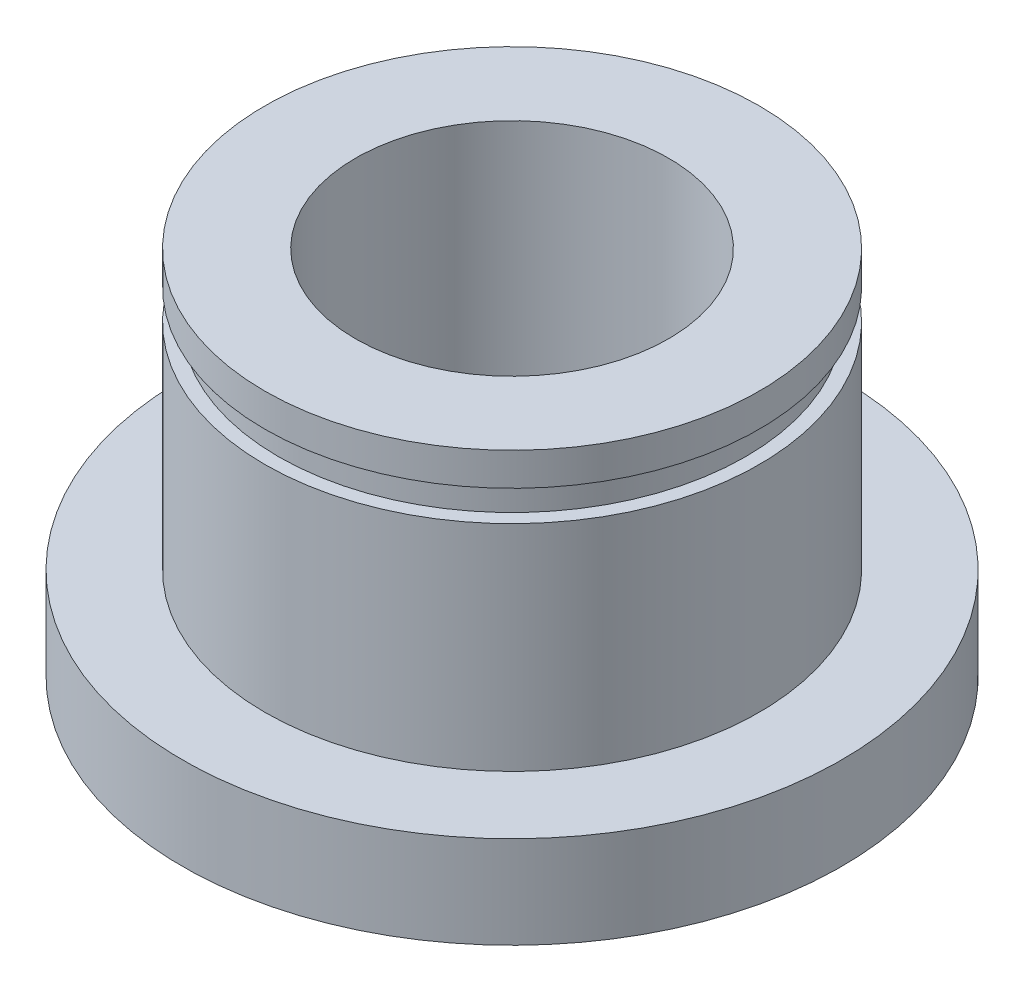
ISO-10303-21;
HEADER;
FILE_DESCRIPTION(('STEP AP214'),'2;1');
FILE_NAME('part.step','',(''),(''),'','','');
FILE_SCHEMA(('AUTOMOTIVE_DESIGN { 1 0 10303 214 1 1 1 1 }'));
ENDSEC;
DATA;
#1=APPLICATION_CONTEXT('core data for automotive mechanical design processes');
#2=APPLICATION_PROTOCOL_DEFINITION('international standard','automotive_design',2000,#1);
#3=PRODUCT_CONTEXT('',#1,'mechanical');
#4=PRODUCT('Part','Part','',(#3));
#5=PRODUCT_RELATED_PRODUCT_CATEGORY('part','',(#4));
#6=PRODUCT_DEFINITION_FORMATION('','',#4);
#7=PRODUCT_DEFINITION_CONTEXT('part definition',#1,'design');
#8=PRODUCT_DEFINITION('design','',#6,#7);
#9=PRODUCT_DEFINITION_SHAPE('','',#8);
#10=(LENGTH_UNIT() NAMED_UNIT(*) SI_UNIT(.MILLI.,.METRE.));
#11=(NAMED_UNIT(*) PLANE_ANGLE_UNIT() SI_UNIT($,.RADIAN.));
#12=(NAMED_UNIT(*) SI_UNIT($,.STERADIAN.) SOLID_ANGLE_UNIT());
#13=UNCERTAINTY_MEASURE_WITH_UNIT(LENGTH_MEASURE(1.E-05),#10,'distance_accuracy_value','');
#14=(GEOMETRIC_REPRESENTATION_CONTEXT(3) GLOBAL_UNCERTAINTY_ASSIGNED_CONTEXT((#13)) GLOBAL_UNIT_ASSIGNED_CONTEXT((#10,
#11,#12)) REPRESENTATION_CONTEXT('',''));
#15=CARTESIAN_POINT('',(0.,0.,0.));
#16=DIRECTION('',(0.,0.,1.));
#17=DIRECTION('',(1.,0.,0.));
#18=AXIS2_PLACEMENT_3D('',#15,#16,#17);
#19=CARTESIAN_POINT('',(0.,-4.460875,0.));
#20=DIRECTION('',(0.,1.,0.));
#21=DIRECTION('',(0.,0.,1.));
#22=AXIS2_PLACEMENT_3D('',#19,#20,#21);
#23=PLANE('',#22);
#24=CARTESIAN_POINT('',(0.,-4.460875,0.));
#25=DIRECTION('',(0.,1.,0.));
#26=DIRECTION('',(0.,0.,1.));
#27=AXIS2_PLACEMENT_3D('',#24,#25,#26);
#28=CIRCLE('',#27,4.564126);
#29=CARTESIAN_POINT('',(0.,-4.460875,4.564126));
#30=VERTEX_POINT('',#29);
#31=EDGE_CURVE('E39',#30,#30,#28,.T.);
#32=ORIENTED_EDGE('',*,*,#31,.T.);
#33=EDGE_LOOP('',(#32));
#34=FACE_BOUND('',#33,.T.);
#35=CARTESIAN_POINT('',(0.,-4.460875,0.));
#36=DIRECTION('',(0.,-1.,0.));
#37=DIRECTION('',(0.,0.,-1.));
#38=AXIS2_PLACEMENT_3D('',#35,#36,#37);
#39=CIRCLE('',#38,7.9375);
#40=CARTESIAN_POINT('',(0.,-4.460875,-7.9375));
#41=VERTEX_POINT('',#40);
#42=EDGE_CURVE('E43',#41,#41,#39,.T.);
#43=ORIENTED_EDGE('',*,*,#42,.T.);
#44=EDGE_LOOP('',(#43));
#45=FACE_BOUND('',#44,.T.);
#46=ADVANCED_FACE('F32',(#34,#45),#23,.F.);
#47=CARTESIAN_POINT('',(0.,0.,0.));
#48=DIRECTION('',(0.,-1.,0.));
#49=DIRECTION('',(0.,0.,-1.));
#50=AXIS2_PLACEMENT_3D('',#47,#48,#49);
#51=CYLINDRICAL_SURFACE('',#50,7.9375);
#52=ORIENTED_EDGE('',*,*,#42,.F.);
#53=EDGE_LOOP('',(#52));
#54=FACE_BOUND('',#53,.T.);
#55=CARTESIAN_POINT('',(0.,-2.238375,0.));
#56=DIRECTION('',(0.,-1.,0.));
#57=DIRECTION('',(0.,0.,-1.));
#58=AXIS2_PLACEMENT_3D('',#55,#56,#57);
#59=CIRCLE('',#58,7.9375);
#60=CARTESIAN_POINT('',(0.,-2.238375,-7.9375));
#61=VERTEX_POINT('',#60);
#62=EDGE_CURVE('E47',#61,#61,#59,.T.);
#63=ORIENTED_EDGE('',*,*,#62,.T.);
#64=EDGE_LOOP('',(#63));
#65=FACE_BOUND('',#64,.T.);
#66=ADVANCED_FACE('F95',(#54,#65),#51,.T.);
#67=CARTESIAN_POINT('',(0.,-2.238375,7.9375));
#68=DIRECTION('',(0.,-1.,0.));
#69=DIRECTION('',(0.,0.,-1.));
#70=AXIS2_PLACEMENT_3D('',#67,#68,#69);
#71=PLANE('',#70);
#72=ORIENTED_EDGE('',*,*,#62,.F.);
#73=EDGE_LOOP('',(#72));
#74=FACE_BOUND('',#73,.T.);
#75=CARTESIAN_POINT('',(0.,-2.238375,0.));
#76=DIRECTION('',(0.,-1.,0.));
#77=DIRECTION('',(0.,0.,-1.));
#78=AXIS2_PLACEMENT_3D('',#75,#76,#77);
#79=CIRCLE('',#78,5.953125);
#80=CARTESIAN_POINT('',(0.,-2.238375,-5.953125));
#81=VERTEX_POINT('',#80);
#82=EDGE_CURVE('E52',#81,#81,#79,.T.);
#83=ORIENTED_EDGE('',*,*,#82,.T.);
#84=EDGE_LOOP('',(#83));
#85=FACE_BOUND('',#84,.T.);
#86=ADVANCED_FACE('F99',(#74,#85),#71,.F.);
#87=CARTESIAN_POINT('',(0.,0.,0.));
#88=DIRECTION('',(0.,-1.,0.));
#89=DIRECTION('',(0.,0.,-1.));
#90=AXIS2_PLACEMENT_3D('',#87,#88,#89);
#91=CYLINDRICAL_SURFACE('',#90,5.953125);
#92=ORIENTED_EDGE('',*,*,#82,.F.);
#93=EDGE_LOOP('',(#92));
#94=FACE_BOUND('',#93,.T.);
#95=CARTESIAN_POINT('',(0.,2.930525,0.));
#96=DIRECTION('',(0.,-1.,0.));
#97=DIRECTION('',(0.,0.,-1.));
#98=AXIS2_PLACEMENT_3D('',#95,#96,#97);
#99=CIRCLE('',#98,5.953125);
#100=CARTESIAN_POINT('',(0.,2.930525,-5.953125));
#101=VERTEX_POINT('',#100);
#102=EDGE_CURVE('E55',#101,#101,#99,.T.);
#103=ORIENTED_EDGE('',*,*,#102,.T.);
#104=EDGE_LOOP('',(#103));
#105=FACE_BOUND('',#104,.T.);
#106=ADVANCED_FACE('F106',(#94,#105),#91,.T.);
#107=CARTESIAN_POINT('',(0.,2.930525,5.953125));
#108=DIRECTION('',(0.,-1.,0.));
#109=DIRECTION('',(0.,0.,-1.));
#110=AXIS2_PLACEMENT_3D('',#107,#108,#109);
#111=PLANE('',#110);
#112=ORIENTED_EDGE('',*,*,#102,.F.);
#113=EDGE_LOOP('',(#112));
#114=FACE_BOUND('',#113,.T.);
#115=CARTESIAN_POINT('',(0.,2.930525,0.));
#116=DIRECTION('',(0.,-1.,0.));
#117=DIRECTION('',(0.,0.,-1.));
#118=AXIS2_PLACEMENT_3D('',#115,#116,#117);
#119=CIRCLE('',#118,5.6261);
#120=CARTESIAN_POINT('',(0.,2.930525,-5.6261));
#121=VERTEX_POINT('',#120);
#122=EDGE_CURVE('E58',#121,#121,#119,.T.);
#123=ORIENTED_EDGE('',*,*,#122,.T.);
#124=EDGE_LOOP('',(#123));
#125=FACE_BOUND('',#124,.T.);
#126=ADVANCED_FACE('F110',(#114,#125),#111,.F.);
#127=CARTESIAN_POINT('',(0.,0.,0.));
#128=DIRECTION('',(0.,-1.,0.));
#129=DIRECTION('',(0.,0.,-1.));
#130=AXIS2_PLACEMENT_3D('',#127,#128,#129);
#131=CYLINDRICAL_SURFACE('',#130,5.6261);
#132=ORIENTED_EDGE('',*,*,#122,.F.);
#133=EDGE_LOOP('',(#132));
#134=FACE_BOUND('',#133,.T.);
#135=CARTESIAN_POINT('',(0.,3.667125,0.));
#136=DIRECTION('',(0.,-1.,0.));
#137=DIRECTION('',(0.,0.,-1.));
#138=AXIS2_PLACEMENT_3D('',#135,#136,#137);
#139=CIRCLE('',#138,5.6261);
#140=CARTESIAN_POINT('',(0.,3.667125,-5.6261));
#141=VERTEX_POINT('',#140);
#142=EDGE_CURVE('E61',#141,#141,#139,.T.);
#143=ORIENTED_EDGE('',*,*,#142,.T.);
#144=EDGE_LOOP('',(#143));
#145=FACE_BOUND('',#144,.T.);
#146=ADVANCED_FACE('F90',(#134,#145),#131,.T.);
#147=CARTESIAN_POINT('',(0.,3.667125,5.6261));
#148=DIRECTION('',(0.,1.,0.));
#149=DIRECTION('',(0.,0.,1.));
#150=AXIS2_PLACEMENT_3D('',#147,#148,#149);
#151=PLANE('',#150);
#152=ORIENTED_EDGE('',*,*,#142,.F.);
#153=EDGE_LOOP('',(#152));
#154=FACE_BOUND('',#153,.T.);
#155=CARTESIAN_POINT('',(0.,3.667125,0.));
#156=DIRECTION('',(0.,-1.,0.));
#157=DIRECTION('',(0.,0.,-1.));
#158=AXIS2_PLACEMENT_3D('',#155,#156,#157);
#159=CIRCLE('',#158,5.953125);
#160=CARTESIAN_POINT('',(0.,3.667125,-5.953125));
#161=VERTEX_POINT('',#160);
#162=EDGE_CURVE('E64',#161,#161,#159,.T.);
#163=ORIENTED_EDGE('',*,*,#162,.T.);
#164=EDGE_LOOP('',(#163));
#165=FACE_BOUND('',#164,.T.);
#166=ADVANCED_FACE('F84',(#154,#165),#151,.F.);
#167=CARTESIAN_POINT('',(0.,0.,0.));
#168=DIRECTION('',(0.,-1.,0.));
#169=DIRECTION('',(0.,0.,-1.));
#170=AXIS2_PLACEMENT_3D('',#167,#168,#169);
#171=CYLINDRICAL_SURFACE('',#170,5.953125);
#172=ORIENTED_EDGE('',*,*,#162,.F.);
#173=EDGE_LOOP('',(#172));
#174=FACE_BOUND('',#173,.T.);
#175=CARTESIAN_POINT('',(0.,4.460875,0.));
#176=DIRECTION('',(0.,-1.,0.));
#177=DIRECTION('',(0.,0.,-1.));
#178=AXIS2_PLACEMENT_3D('',#175,#176,#177);
#179=CIRCLE('',#178,5.953125);
#180=CARTESIAN_POINT('',(0.,4.460875,-5.953125));
#181=VERTEX_POINT('',#180);
#182=EDGE_CURVE('E67',#181,#181,#179,.T.);
#183=ORIENTED_EDGE('',*,*,#182,.T.);
#184=EDGE_LOOP('',(#183));
#185=FACE_BOUND('',#184,.T.);
#186=ADVANCED_FACE('F79',(#174,#185),#171,.T.);
#187=CARTESIAN_POINT('',(0.,4.460875,5.953125));
#188=DIRECTION('',(0.,-1.,0.));
#189=DIRECTION('',(0.,0.,-1.));
#190=AXIS2_PLACEMENT_3D('',#187,#188,#189);
#191=PLANE('',#190);
#192=CARTESIAN_POINT('',(0.,4.460875,0.));
#193=DIRECTION('',(0.,1.,0.));
#194=DIRECTION('',(0.,0.,1.));
#195=AXIS2_PLACEMENT_3D('',#192,#193,#194);
#196=CIRCLE('',#195,3.77037599999999);
#197=CARTESIAN_POINT('',(0.,4.460875,3.77037599999999));
#198=VERTEX_POINT('',#197);
#199=EDGE_CURVE('E70',#198,#198,#196,.T.);
#200=ORIENTED_EDGE('',*,*,#199,.F.);
#201=EDGE_LOOP('',(#200));
#202=FACE_BOUND('',#201,.T.);
#203=ORIENTED_EDGE('',*,*,#182,.F.);
#204=EDGE_LOOP('',(#203));
#205=FACE_BOUND('',#204,.T.);
#206=ADVANCED_FACE('F76',(#202,#205),#191,.F.);
#207=CARTESIAN_POINT('',(0.,4.460875,0.));
#208=DIRECTION('',(0.,1.,0.));
#209=DIRECTION('',(0.,0.,1.));
#210=AXIS2_PLACEMENT_3D('',#207,#208,#209);
#211=CYLINDRICAL_SURFACE('',#210,3.77037599999999);
#212=CARTESIAN_POINT('',(0.,-3.66712499999999,0.));
#213=DIRECTION('',(0.,1.,0.));
#214=DIRECTION('',(0.,0.,1.));
#215=AXIS2_PLACEMENT_3D('',#212,#213,#214);
#216=CIRCLE('',#215,3.77037599999999);
#217=CARTESIAN_POINT('',(0.,-3.66712499999999,3.77037599999999));
#218=VERTEX_POINT('',#217);
#219=EDGE_CURVE('E10',#218,#218,#216,.F.);
#220=ORIENTED_EDGE('',*,*,#219,.T.);
#221=EDGE_LOOP('',(#220));
#222=FACE_BOUND('',#221,.T.);
#223=ORIENTED_EDGE('',*,*,#199,.T.);
#224=EDGE_LOOP('',(#223));
#225=FACE_BOUND('',#224,.T.);
#226=ADVANCED_FACE('F74',(#222,#225),#211,.F.);
#227=CARTESIAN_POINT('',(0.,-4.460875,0.));
#228=DIRECTION('',(0.,-1.,0.));
#229=DIRECTION('',(0.,0.,-1.));
#230=AXIS2_PLACEMENT_3D('',#227,#228,#229);
#231=CONICAL_SURFACE('',#230,4.564126,0.785398163397447);
#232=ORIENTED_EDGE('',*,*,#219,.F.);
#233=EDGE_LOOP('',(#232));
#234=FACE_BOUND('',#233,.T.);
#235=ORIENTED_EDGE('',*,*,#31,.F.);
#236=EDGE_LOOP('',(#235));
#237=FACE_BOUND('',#236,.T.);
#238=ADVANCED_FACE('F34',(#234,#237),#231,.F.);
#239=CLOSED_SHELL('',(#46,#66,#86,#106,#126,#146,#166,#186,#206,#226,#238));
#240=MANIFOLD_SOLID_BREP('B2',#239);
#241=ADVANCED_BREP_SHAPE_REPRESENTATION('',(#18,#240),#14);
#242=SHAPE_DEFINITION_REPRESENTATION(#9,#241);
ENDSEC;
END-ISO-10303-21;
